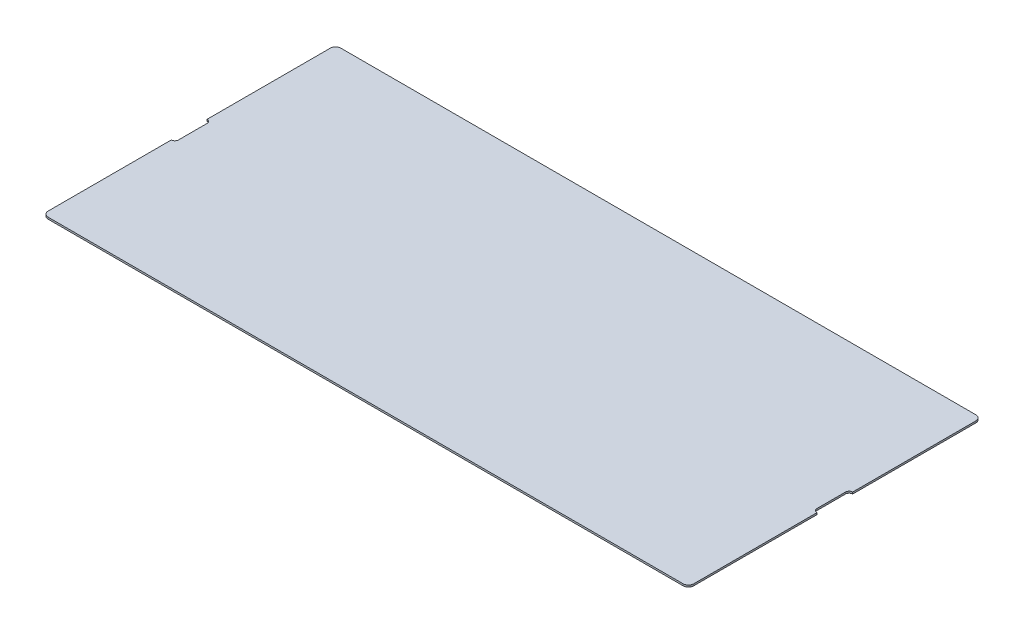
ISO-10303-21;
HEADER;
FILE_DESCRIPTION(('STEP AP214'),'2;1');
FILE_NAME('part.step','',(''),(''),'','','');
FILE_SCHEMA(('AUTOMOTIVE_DESIGN { 1 0 10303 214 1 1 1 1 }'));
ENDSEC;
DATA;
#1=APPLICATION_CONTEXT('core data for automotive mechanical design processes');
#2=APPLICATION_PROTOCOL_DEFINITION('international standard','automotive_design',2000,#1);
#3=PRODUCT_CONTEXT('',#1,'mechanical');
#4=PRODUCT('Part','Part','',(#3));
#5=PRODUCT_RELATED_PRODUCT_CATEGORY('part','',(#4));
#6=PRODUCT_DEFINITION_FORMATION('','',#4);
#7=PRODUCT_DEFINITION_CONTEXT('part definition',#1,'design');
#8=PRODUCT_DEFINITION('design','',#6,#7);
#9=PRODUCT_DEFINITION_SHAPE('','',#8);
#10=(LENGTH_UNIT() NAMED_UNIT(*) SI_UNIT(.MILLI.,.METRE.));
#11=(NAMED_UNIT(*) PLANE_ANGLE_UNIT() SI_UNIT($,.RADIAN.));
#12=(NAMED_UNIT(*) SI_UNIT($,.STERADIAN.) SOLID_ANGLE_UNIT());
#13=UNCERTAINTY_MEASURE_WITH_UNIT(LENGTH_MEASURE(1.E-05),#10,'distance_accuracy_value','');
#14=(GEOMETRIC_REPRESENTATION_CONTEXT(3) GLOBAL_UNCERTAINTY_ASSIGNED_CONTEXT((#13)) GLOBAL_UNIT_ASSIGNED_CONTEXT((#10,
#11,#12)) REPRESENTATION_CONTEXT('',''));
#15=CARTESIAN_POINT('',(0.,0.,0.));
#16=DIRECTION('',(0.,0.,1.));
#17=DIRECTION('',(1.,0.,0.));
#18=AXIS2_PLACEMENT_3D('',#15,#16,#17);
#19=CARTESIAN_POINT('',(90.2,0.5,0.));
#20=DIRECTION('',(1.,0.,0.));
#21=DIRECTION('',(0.,0.,-1.));
#22=AXIS2_PLACEMENT_3D('',#19,#20,#21);
#23=PLANE('',#22);
#24=DIRECTION('',(0.,0.,1.));
#25=VECTOR('',#24,1.);
#26=CARTESIAN_POINT('',(90.2,0.,0.));
#27=LINE('',#26,#25);
#28=CARTESIAN_POINT('',(90.2,0.,4.99999999999997));
#29=VERTEX_POINT('',#28);
#30=CARTESIAN_POINT('',(90.2,0.,39.4));
#31=VERTEX_POINT('',#30);
#32=EDGE_CURVE('E177',#29,#31,#27,.T.);
#33=ORIENTED_EDGE('',*,*,#32,.F.);
#34=DIRECTION('',(0.,-1.,0.));
#35=VECTOR('',#34,1.);
#36=CARTESIAN_POINT('',(90.2,0.5,4.99999999999997));
#37=LINE('',#36,#35);
#38=CARTESIAN_POINT('',(90.2,0.5,4.99999999999997));
#39=VERTEX_POINT('',#38);
#40=EDGE_CURVE('E11',#39,#29,#37,.T.);
#41=ORIENTED_EDGE('',*,*,#40,.F.);
#42=DIRECTION('',(0.,0.,1.));
#43=VECTOR('',#42,1.);
#44=CARTESIAN_POINT('',(90.2,0.5,0.));
#45=LINE('',#44,#43);
#46=CARTESIAN_POINT('',(90.2,0.5,39.4));
#47=VERTEX_POINT('',#46);
#48=EDGE_CURVE('E215',#39,#47,#45,.T.);
#49=ORIENTED_EDGE('',*,*,#48,.T.);
#50=DIRECTION('',(0.,-1.,0.));
#51=VECTOR('',#50,1.);
#52=CARTESIAN_POINT('',(90.2,0.5,39.4));
#53=LINE('',#52,#51);
#54=EDGE_CURVE('E110',#47,#31,#53,.T.);
#55=ORIENTED_EDGE('',*,*,#54,.T.);
#56=EDGE_LOOP('',(#33,#41,#49,#55));
#57=FACE_BOUND('',#56,.T.);
#58=ADVANCED_FACE('F34',(#57),#23,.T.);
#59=CARTESIAN_POINT('',(90.2,0.5,3.99999999999997));
#60=DIRECTION('',(0.,-1.,0.));
#61=DIRECTION('',(0.,0.,-1.));
#62=AXIS2_PLACEMENT_3D('',#59,#60,#61);
#63=CYLINDRICAL_SURFACE('',#62,1.);
#64=CARTESIAN_POINT('',(90.2,0.,3.99999999999997));
#65=DIRECTION('',(0.,1.,0.));
#66=DIRECTION('',(0.,0.,1.));
#67=AXIS2_PLACEMENT_3D('',#64,#65,#66);
#68=CIRCLE('',#67,1.);
#69=CARTESIAN_POINT('',(89.2,0.,3.99999999999997));
#70=VERTEX_POINT('',#69);
#71=EDGE_CURVE('E180',#29,#70,#68,.F.);
#72=ORIENTED_EDGE('',*,*,#71,.T.);
#73=DIRECTION('',(0.,-1.,0.));
#74=VECTOR('',#73,1.);
#75=CARTESIAN_POINT('',(89.2,0.5,3.99999999999997));
#76=LINE('',#75,#74);
#77=CARTESIAN_POINT('',(89.2,0.5,3.99999999999997));
#78=VERTEX_POINT('',#77);
#79=EDGE_CURVE('E43',#78,#70,#76,.T.);
#80=ORIENTED_EDGE('',*,*,#79,.F.);
#81=CARTESIAN_POINT('',(90.2,0.5,3.99999999999997));
#82=DIRECTION('',(0.,1.,0.));
#83=DIRECTION('',(0.,0.,1.));
#84=AXIS2_PLACEMENT_3D('',#81,#82,#83);
#85=CIRCLE('',#84,1.);
#86=EDGE_CURVE('E262',#39,#78,#85,.F.);
#87=ORIENTED_EDGE('',*,*,#86,.F.);
#88=ORIENTED_EDGE('',*,*,#40,.T.);
#89=EDGE_LOOP('',(#72,#80,#87,#88));
#90=FACE_BOUND('',#89,.T.);
#91=ADVANCED_FACE('F36',(#90),#63,.F.);
#92=CARTESIAN_POINT('',(89.2,0.5,-3.09474668114262E-13));
#93=DIRECTION('',(1.,0.,0.));
#94=DIRECTION('',(0.,0.,-1.));
#95=AXIS2_PLACEMENT_3D('',#92,#93,#94);
#96=PLANE('',#95);
#97=DIRECTION('',(0.,0.,1.));
#98=VECTOR('',#97,1.);
#99=CARTESIAN_POINT('',(89.2,0.,-3.09474668114262E-13));
#100=LINE('',#99,#98);
#101=CARTESIAN_POINT('',(89.2,0.,-4.00000000000003));
#102=VERTEX_POINT('',#101);
#103=EDGE_CURVE('E184',#102,#70,#100,.T.);
#104=ORIENTED_EDGE('',*,*,#103,.F.);
#105=DIRECTION('',(0.,-1.,0.));
#106=VECTOR('',#105,1.);
#107=CARTESIAN_POINT('',(89.2,0.5,-4.00000000000003));
#108=LINE('',#107,#106);
#109=CARTESIAN_POINT('',(89.2,0.5,-4.00000000000003));
#110=VERTEX_POINT('',#109);
#111=EDGE_CURVE('E238',#110,#102,#108,.T.);
#112=ORIENTED_EDGE('',*,*,#111,.F.);
#113=DIRECTION('',(0.,0.,1.));
#114=VECTOR('',#113,1.);
#115=CARTESIAN_POINT('',(89.2,0.5,-3.09474668114262E-13));
#116=LINE('',#115,#114);
#117=EDGE_CURVE('E245',#110,#78,#116,.T.);
#118=ORIENTED_EDGE('',*,*,#117,.T.);
#119=ORIENTED_EDGE('',*,*,#79,.T.);
#120=EDGE_LOOP('',(#104,#112,#118,#119));
#121=FACE_BOUND('',#120,.T.);
#122=ADVANCED_FACE('F243',(#121),#96,.T.);
#123=CARTESIAN_POINT('',(90.2,0.5,-4.00000000000003));
#124=DIRECTION('',(0.,-1.,0.));
#125=DIRECTION('',(0.,0.,-1.));
#126=AXIS2_PLACEMENT_3D('',#123,#124,#125);
#127=CYLINDRICAL_SURFACE('',#126,1.);
#128=CARTESIAN_POINT('',(90.2,0.,-4.00000000000003));
#129=DIRECTION('',(0.,1.,0.));
#130=DIRECTION('',(0.,0.,1.));
#131=AXIS2_PLACEMENT_3D('',#128,#129,#130);
#132=CIRCLE('',#131,1.);
#133=CARTESIAN_POINT('',(90.2,0.,-5.00000000000003));
#134=VERTEX_POINT('',#133);
#135=EDGE_CURVE('E187',#102,#134,#132,.F.);
#136=ORIENTED_EDGE('',*,*,#135,.T.);
#137=DIRECTION('',(0.,-1.,0.));
#138=VECTOR('',#137,1.);
#139=CARTESIAN_POINT('',(90.2,0.5,-5.00000000000003));
#140=LINE('',#139,#138);
#141=CARTESIAN_POINT('',(90.2,0.5,-5.00000000000003));
#142=VERTEX_POINT('',#141);
#143=EDGE_CURVE('E236',#142,#134,#140,.T.);
#144=ORIENTED_EDGE('',*,*,#143,.F.);
#145=CARTESIAN_POINT('',(90.2,0.5,-4.00000000000003));
#146=DIRECTION('',(0.,1.,0.));
#147=DIRECTION('',(0.,0.,1.));
#148=AXIS2_PLACEMENT_3D('',#145,#146,#147);
#149=CIRCLE('',#148,1.);
#150=EDGE_CURVE('E258',#110,#142,#149,.F.);
#151=ORIENTED_EDGE('',*,*,#150,.F.);
#152=ORIENTED_EDGE('',*,*,#111,.T.);
#153=EDGE_LOOP('',(#136,#144,#151,#152));
#154=FACE_BOUND('',#153,.T.);
#155=ADVANCED_FACE('F255',(#154),#127,.F.);
#156=CARTESIAN_POINT('',(90.2,0.,-39.4));
#157=VERTEX_POINT('',#156);
#158=EDGE_CURVE('E181',#157,#134,#27,.T.);
#159=ORIENTED_EDGE('',*,*,#158,.F.);
#160=DIRECTION('',(0.,-1.,0.));
#161=VECTOR('',#160,1.);
#162=CARTESIAN_POINT('',(90.2,0.5,-39.4));
#163=LINE('',#162,#161);
#164=CARTESIAN_POINT('',(90.2,0.5,-39.4));
#165=VERTEX_POINT('',#164);
#166=EDGE_CURVE('E234',#165,#157,#163,.T.);
#167=ORIENTED_EDGE('',*,*,#166,.F.);
#168=EDGE_CURVE('E260',#165,#142,#45,.T.);
#169=ORIENTED_EDGE('',*,*,#168,.T.);
#170=ORIENTED_EDGE('',*,*,#143,.T.);
#171=EDGE_LOOP('',(#159,#167,#169,#170));
#172=FACE_BOUND('',#171,.T.);
#173=ADVANCED_FACE('F311',(#172),#23,.T.);
#174=CARTESIAN_POINT('',(88.7,0.5,-39.4));
#175=DIRECTION('',(0.,-1.,0.));
#176=DIRECTION('',(0.,0.,-1.));
#177=AXIS2_PLACEMENT_3D('',#174,#175,#176);
#178=CYLINDRICAL_SURFACE('',#177,1.5);
#179=CARTESIAN_POINT('',(88.7,0.,-39.4));
#180=DIRECTION('',(0.,1.,0.));
#181=DIRECTION('',(0.,0.,1.));
#182=AXIS2_PLACEMENT_3D('',#179,#180,#181);
#183=CIRCLE('',#182,1.5);
#184=CARTESIAN_POINT('',(88.7,0.,-40.9));
#185=VERTEX_POINT('',#184);
#186=EDGE_CURVE('E190',#185,#157,#183,.F.);
#187=ORIENTED_EDGE('',*,*,#186,.F.);
#188=DIRECTION('',(0.,-1.,0.));
#189=VECTOR('',#188,1.);
#190=CARTESIAN_POINT('',(88.7,0.5,-40.9));
#191=LINE('',#190,#189);
#192=CARTESIAN_POINT('',(88.7,0.5,-40.9));
#193=VERTEX_POINT('',#192);
#194=EDGE_CURVE('E232',#193,#185,#191,.T.);
#195=ORIENTED_EDGE('',*,*,#194,.F.);
#196=CARTESIAN_POINT('',(88.7,0.5,-39.4));
#197=DIRECTION('',(0.,1.,0.));
#198=DIRECTION('',(0.,0.,1.));
#199=AXIS2_PLACEMENT_3D('',#196,#197,#198);
#200=CIRCLE('',#199,1.5);
#201=EDGE_CURVE('E267',#193,#165,#200,.F.);
#202=ORIENTED_EDGE('',*,*,#201,.T.);
#203=ORIENTED_EDGE('',*,*,#166,.T.);
#204=EDGE_LOOP('',(#187,#195,#202,#203));
#205=FACE_BOUND('',#204,.T.);
#206=ADVANCED_FACE('F318',(#205),#178,.T.);
#207=CARTESIAN_POINT('',(0.,0.5,-40.9));
#208=DIRECTION('',(0.,0.,-1.));
#209=DIRECTION('',(-1.,0.,0.));
#210=AXIS2_PLACEMENT_3D('',#207,#208,#209);
#211=PLANE('',#210);
#212=DIRECTION('',(1.,0.,0.));
#213=VECTOR('',#212,1.);
#214=CARTESIAN_POINT('',(0.,0.,-40.9));
#215=LINE('',#214,#213);
#216=CARTESIAN_POINT('',(-88.7,0.,-40.9));
#217=VERTEX_POINT('',#216);
#218=EDGE_CURVE('E193',#217,#185,#215,.T.);
#219=ORIENTED_EDGE('',*,*,#218,.F.);
#220=DIRECTION('',(0.,-1.,0.));
#221=VECTOR('',#220,1.);
#222=CARTESIAN_POINT('',(-88.7,0.5,-40.9));
#223=LINE('',#222,#221);
#224=CARTESIAN_POINT('',(-88.7,0.5,-40.9));
#225=VERTEX_POINT('',#224);
#226=EDGE_CURVE('E230',#225,#217,#223,.T.);
#227=ORIENTED_EDGE('',*,*,#226,.F.);
#228=DIRECTION('',(1.,0.,0.));
#229=VECTOR('',#228,1.);
#230=CARTESIAN_POINT('',(0.,0.5,-40.9));
#231=LINE('',#230,#229);
#232=EDGE_CURVE('E270',#225,#193,#231,.T.);
#233=ORIENTED_EDGE('',*,*,#232,.T.);
#234=ORIENTED_EDGE('',*,*,#194,.T.);
#235=EDGE_LOOP('',(#219,#227,#233,#234));
#236=FACE_BOUND('',#235,.T.);
#237=ADVANCED_FACE('F324',(#236),#211,.T.);
#238=CARTESIAN_POINT('',(-88.7,0.5,-39.4));
#239=DIRECTION('',(0.,-1.,0.));
#240=DIRECTION('',(0.,0.,-1.));
#241=AXIS2_PLACEMENT_3D('',#238,#239,#240);
#242=CYLINDRICAL_SURFACE('',#241,1.5);
#243=CARTESIAN_POINT('',(-88.7,0.,-39.4));
#244=DIRECTION('',(0.,1.,0.));
#245=DIRECTION('',(0.,0.,1.));
#246=AXIS2_PLACEMENT_3D('',#243,#244,#245);
#247=CIRCLE('',#246,1.5);
#248=CARTESIAN_POINT('',(-90.2,0.,-39.4));
#249=VERTEX_POINT('',#248);
#250=EDGE_CURVE('E196',#217,#249,#247,.T.);
#251=ORIENTED_EDGE('',*,*,#250,.T.);
#252=DIRECTION('',(0.,-1.,0.));
#253=VECTOR('',#252,1.);
#254=CARTESIAN_POINT('',(-90.2,0.5,-39.4));
#255=LINE('',#254,#253);
#256=CARTESIAN_POINT('',(-90.2,0.5,-39.4));
#257=VERTEX_POINT('',#256);
#258=EDGE_CURVE('E227',#257,#249,#255,.T.);
#259=ORIENTED_EDGE('',*,*,#258,.F.);
#260=CARTESIAN_POINT('',(-88.7,0.5,-39.4));
#261=DIRECTION('',(0.,1.,0.));
#262=DIRECTION('',(0.,0.,1.));
#263=AXIS2_PLACEMENT_3D('',#260,#261,#262);
#264=CIRCLE('',#263,1.5);
#265=EDGE_CURVE('E273',#225,#257,#264,.T.);
#266=ORIENTED_EDGE('',*,*,#265,.F.);
#267=ORIENTED_EDGE('',*,*,#226,.T.);
#268=EDGE_LOOP('',(#251,#259,#266,#267));
#269=FACE_BOUND('',#268,.T.);
#270=ADVANCED_FACE('F307',(#269),#242,.T.);
#271=CARTESIAN_POINT('',(-90.2,0.5,0.));
#272=DIRECTION('',(1.,0.,0.));
#273=DIRECTION('',(0.,0.,-1.));
#274=AXIS2_PLACEMENT_3D('',#271,#272,#273);
#275=PLANE('',#274);
#276=DIRECTION('',(0.,0.,1.));
#277=VECTOR('',#276,1.);
#278=CARTESIAN_POINT('',(-90.2,0.,0.));
#279=LINE('',#278,#277);
#280=CARTESIAN_POINT('',(-90.2,0.,-5.));
#281=VERTEX_POINT('',#280);
#282=EDGE_CURVE('E198',#249,#281,#279,.T.);
#283=ORIENTED_EDGE('',*,*,#282,.T.);
#284=DIRECTION('',(0.,-1.,0.));
#285=VECTOR('',#284,1.);
#286=CARTESIAN_POINT('',(-90.2,0.5,-5.));
#287=LINE('',#286,#285);
#288=CARTESIAN_POINT('',(-90.2,0.5,-5.));
#289=VERTEX_POINT('',#288);
#290=EDGE_CURVE('E225',#289,#281,#287,.T.);
#291=ORIENTED_EDGE('',*,*,#290,.F.);
#292=DIRECTION('',(0.,0.,1.));
#293=VECTOR('',#292,1.);
#294=CARTESIAN_POINT('',(-90.2,0.5,0.));
#295=LINE('',#294,#293);
#296=EDGE_CURVE('E275',#257,#289,#295,.T.);
#297=ORIENTED_EDGE('',*,*,#296,.F.);
#298=ORIENTED_EDGE('',*,*,#258,.T.);
#299=EDGE_LOOP('',(#283,#291,#297,#298));
#300=FACE_BOUND('',#299,.T.);
#301=ADVANCED_FACE('F298',(#300),#275,.F.);
#302=CARTESIAN_POINT('',(-90.2,0.5,-4.));
#303=DIRECTION('',(0.,-1.,0.));
#304=DIRECTION('',(0.,0.,-1.));
#305=AXIS2_PLACEMENT_3D('',#302,#303,#304);
#306=CYLINDRICAL_SURFACE('',#305,1.);
#307=CARTESIAN_POINT('',(-90.2,0.,-4.));
#308=DIRECTION('',(0.,1.,0.));
#309=DIRECTION('',(0.,0.,1.));
#310=AXIS2_PLACEMENT_3D('',#307,#308,#309);
#311=CIRCLE('',#310,1.);
#312=CARTESIAN_POINT('',(-89.2,0.,-4.));
#313=VERTEX_POINT('',#312);
#314=EDGE_CURVE('E201',#313,#281,#311,.T.);
#315=ORIENTED_EDGE('',*,*,#314,.F.);
#316=DIRECTION('',(0.,-1.,0.));
#317=VECTOR('',#316,1.);
#318=CARTESIAN_POINT('',(-89.2,0.5,-4.));
#319=LINE('',#318,#317);
#320=CARTESIAN_POINT('',(-89.2,0.5,-4.));
#321=VERTEX_POINT('',#320);
#322=EDGE_CURVE('E223',#321,#313,#319,.T.);
#323=ORIENTED_EDGE('',*,*,#322,.F.);
#324=CARTESIAN_POINT('',(-90.2,0.5,-4.));
#325=DIRECTION('',(0.,1.,0.));
#326=DIRECTION('',(0.,0.,1.));
#327=AXIS2_PLACEMENT_3D('',#324,#325,#326);
#328=CIRCLE('',#327,1.);
#329=EDGE_CURVE('E277',#321,#289,#328,.T.);
#330=ORIENTED_EDGE('',*,*,#329,.T.);
#331=ORIENTED_EDGE('',*,*,#290,.T.);
#332=EDGE_LOOP('',(#315,#323,#330,#331));
#333=FACE_BOUND('',#332,.T.);
#334=ADVANCED_FACE('F306',(#333),#306,.F.);
#335=CARTESIAN_POINT('',(-89.2,0.5,0.));
#336=DIRECTION('',(1.,0.,0.));
#337=DIRECTION('',(0.,0.,-1.));
#338=AXIS2_PLACEMENT_3D('',#335,#336,#337);
#339=PLANE('',#338);
#340=DIRECTION('',(0.,0.,1.));
#341=VECTOR('',#340,1.);
#342=CARTESIAN_POINT('',(-89.2,0.,0.));
#343=LINE('',#342,#341);
#344=CARTESIAN_POINT('',(-89.2,0.,4.));
#345=VERTEX_POINT('',#344);
#346=EDGE_CURVE('E205',#313,#345,#343,.T.);
#347=ORIENTED_EDGE('',*,*,#346,.T.);
#348=DIRECTION('',(0.,-1.,0.));
#349=VECTOR('',#348,1.);
#350=CARTESIAN_POINT('',(-89.2,0.5,4.));
#351=LINE('',#350,#349);
#352=CARTESIAN_POINT('',(-89.2,0.5,4.));
#353=VERTEX_POINT('',#352);
#354=EDGE_CURVE('E221',#353,#345,#351,.T.);
#355=ORIENTED_EDGE('',*,*,#354,.F.);
#356=DIRECTION('',(0.,0.,1.));
#357=VECTOR('',#356,1.);
#358=CARTESIAN_POINT('',(-89.2,0.5,0.));
#359=LINE('',#358,#357);
#360=EDGE_CURVE('E280',#321,#353,#359,.T.);
#361=ORIENTED_EDGE('',*,*,#360,.F.);
#362=ORIENTED_EDGE('',*,*,#322,.T.);
#363=EDGE_LOOP('',(#347,#355,#361,#362));
#364=FACE_BOUND('',#363,.T.);
#365=ADVANCED_FACE('F290',(#364),#339,.F.);
#366=CARTESIAN_POINT('',(-90.2,0.5,4.));
#367=DIRECTION('',(0.,-1.,0.));
#368=DIRECTION('',(0.,0.,-1.));
#369=AXIS2_PLACEMENT_3D('',#366,#367,#368);
#370=CYLINDRICAL_SURFACE('',#369,1.);
#371=CARTESIAN_POINT('',(-90.2,0.,4.));
#372=DIRECTION('',(0.,1.,0.));
#373=DIRECTION('',(0.,0.,1.));
#374=AXIS2_PLACEMENT_3D('',#371,#372,#373);
#375=CIRCLE('',#374,1.);
#376=CARTESIAN_POINT('',(-90.2,0.,5.));
#377=VERTEX_POINT('',#376);
#378=EDGE_CURVE('E208',#377,#345,#375,.T.);
#379=ORIENTED_EDGE('',*,*,#378,.F.);
#380=DIRECTION('',(0.,-1.,0.));
#381=VECTOR('',#380,1.);
#382=CARTESIAN_POINT('',(-90.2,0.5,5.));
#383=LINE('',#382,#381);
#384=CARTESIAN_POINT('',(-90.2,0.5,5.));
#385=VERTEX_POINT('',#384);
#386=EDGE_CURVE('E219',#385,#377,#383,.T.);
#387=ORIENTED_EDGE('',*,*,#386,.F.);
#388=CARTESIAN_POINT('',(-90.2,0.5,4.));
#389=DIRECTION('',(0.,1.,0.));
#390=DIRECTION('',(0.,0.,1.));
#391=AXIS2_PLACEMENT_3D('',#388,#389,#390);
#392=CIRCLE('',#391,1.);
#393=EDGE_CURVE('E281',#385,#353,#392,.T.);
#394=ORIENTED_EDGE('',*,*,#393,.T.);
#395=ORIENTED_EDGE('',*,*,#354,.T.);
#396=EDGE_LOOP('',(#379,#387,#394,#395));
#397=FACE_BOUND('',#396,.T.);
#398=ADVANCED_FACE('F285',(#397),#370,.F.);
#399=CARTESIAN_POINT('',(-90.2,0.,39.4));
#400=VERTEX_POINT('',#399);
#401=EDGE_CURVE('E202',#377,#400,#279,.T.);
#402=ORIENTED_EDGE('',*,*,#401,.T.);
#403=DIRECTION('',(0.,-1.,0.));
#404=VECTOR('',#403,1.);
#405=CARTESIAN_POINT('',(-90.2,0.5,39.4));
#406=LINE('',#405,#404);
#407=CARTESIAN_POINT('',(-90.2,0.5,39.4));
#408=VERTEX_POINT('',#407);
#409=EDGE_CURVE('E169',#408,#400,#406,.T.);
#410=ORIENTED_EDGE('',*,*,#409,.F.);
#411=EDGE_CURVE('E160',#385,#408,#295,.T.);
#412=ORIENTED_EDGE('',*,*,#411,.F.);
#413=ORIENTED_EDGE('',*,*,#386,.T.);
#414=EDGE_LOOP('',(#402,#410,#412,#413));
#415=FACE_BOUND('',#414,.T.);
#416=ADVANCED_FACE('F295',(#415),#275,.F.);
#417=CARTESIAN_POINT('',(-88.7,0.5,39.4));
#418=DIRECTION('',(0.,-1.,0.));
#419=DIRECTION('',(0.,0.,-1.));
#420=AXIS2_PLACEMENT_3D('',#417,#418,#419);
#421=CYLINDRICAL_SURFACE('',#420,1.5);
#422=CARTESIAN_POINT('',(-88.7,0.,39.4));
#423=DIRECTION('',(0.,1.,0.));
#424=DIRECTION('',(0.,0.,1.));
#425=AXIS2_PLACEMENT_3D('',#422,#423,#424);
#426=CIRCLE('',#425,1.5);
#427=CARTESIAN_POINT('',(-88.7,0.,40.9));
#428=VERTEX_POINT('',#427);
#429=EDGE_CURVE('E168',#400,#428,#426,.T.);
#430=ORIENTED_EDGE('',*,*,#429,.T.);
#431=DIRECTION('',(0.,-1.,0.));
#432=VECTOR('',#431,1.);
#433=CARTESIAN_POINT('',(-88.7,0.5,40.9));
#434=LINE('',#433,#432);
#435=CARTESIAN_POINT('',(-88.7,0.5,40.9));
#436=VERTEX_POINT('',#435);
#437=EDGE_CURVE('E165',#436,#428,#434,.T.);
#438=ORIENTED_EDGE('',*,*,#437,.F.);
#439=CARTESIAN_POINT('',(-88.7,0.5,39.4));
#440=DIRECTION('',(0.,1.,0.));
#441=DIRECTION('',(0.,0.,1.));
#442=AXIS2_PLACEMENT_3D('',#439,#440,#441);
#443=CIRCLE('',#442,1.5);
#444=EDGE_CURVE('E153',#408,#436,#443,.T.);
#445=ORIENTED_EDGE('',*,*,#444,.F.);
#446=ORIENTED_EDGE('',*,*,#409,.T.);
#447=EDGE_LOOP('',(#430,#438,#445,#446));
#448=FACE_BOUND('',#447,.T.);
#449=ADVANCED_FACE('F166',(#448),#421,.T.);
#450=CARTESIAN_POINT('',(0.,0.5,40.9));
#451=DIRECTION('',(0.,0.,-1.));
#452=DIRECTION('',(-1.,0.,0.));
#453=AXIS2_PLACEMENT_3D('',#450,#451,#452);
#454=PLANE('',#453);
#455=DIRECTION('',(1.,0.,0.));
#456=VECTOR('',#455,1.);
#457=CARTESIAN_POINT('',(0.,0.,40.9));
#458=LINE('',#457,#456);
#459=CARTESIAN_POINT('',(88.7,0.,40.9));
#460=VERTEX_POINT('',#459);
#461=EDGE_CURVE('E103',#428,#460,#458,.T.);
#462=ORIENTED_EDGE('',*,*,#461,.T.);
#463=DIRECTION('',(0.,-1.,0.));
#464=VECTOR('',#463,1.);
#465=CARTESIAN_POINT('',(88.7,0.5,40.9));
#466=LINE('',#465,#464);
#467=CARTESIAN_POINT('',(88.7,0.5,40.9));
#468=VERTEX_POINT('',#467);
#469=EDGE_CURVE('E170',#468,#460,#466,.T.);
#470=ORIENTED_EDGE('',*,*,#469,.F.);
#471=DIRECTION('',(1.,0.,0.));
#472=VECTOR('',#471,1.);
#473=CARTESIAN_POINT('',(0.,0.5,40.9));
#474=LINE('',#473,#472);
#475=EDGE_CURVE('E157',#436,#468,#474,.T.);
#476=ORIENTED_EDGE('',*,*,#475,.F.);
#477=ORIENTED_EDGE('',*,*,#437,.T.);
#478=EDGE_LOOP('',(#462,#470,#476,#477));
#479=FACE_BOUND('',#478,.T.);
#480=ADVANCED_FACE('F172',(#479),#454,.F.);
#481=CARTESIAN_POINT('',(88.7,0.5,39.4));
#482=DIRECTION('',(0.,-1.,0.));
#483=DIRECTION('',(0.,0.,-1.));
#484=AXIS2_PLACEMENT_3D('',#481,#482,#483);
#485=CYLINDRICAL_SURFACE('',#484,1.5);
#486=CARTESIAN_POINT('',(88.7,0.,39.4));
#487=DIRECTION('',(0.,1.,0.));
#488=DIRECTION('',(0.,0.,1.));
#489=AXIS2_PLACEMENT_3D('',#486,#487,#488);
#490=CIRCLE('',#489,1.5);
#491=EDGE_CURVE('E213',#460,#31,#490,.T.);
#492=ORIENTED_EDGE('',*,*,#491,.T.);
#493=ORIENTED_EDGE('',*,*,#54,.F.);
#494=CARTESIAN_POINT('',(88.7,0.5,39.4));
#495=DIRECTION('',(0.,1.,0.));
#496=DIRECTION('',(0.,0.,1.));
#497=AXIS2_PLACEMENT_3D('',#494,#495,#496);
#498=CIRCLE('',#497,1.5);
#499=EDGE_CURVE('E51',#468,#47,#498,.T.);
#500=ORIENTED_EDGE('',*,*,#499,.F.);
#501=ORIENTED_EDGE('',*,*,#469,.T.);
#502=EDGE_LOOP('',(#492,#493,#500,#501));
#503=FACE_BOUND('',#502,.T.);
#504=ADVANCED_FACE('F396',(#503),#485,.T.);
#505=CARTESIAN_POINT('',(0.,0.5,0.));
#506=DIRECTION('',(0.,1.,0.));
#507=DIRECTION('',(0.,0.,1.));
#508=AXIS2_PLACEMENT_3D('',#505,#506,#507);
#509=PLANE('',#508);
#510=ORIENTED_EDGE('',*,*,#48,.F.);
#511=ORIENTED_EDGE('',*,*,#86,.T.);
#512=ORIENTED_EDGE('',*,*,#117,.F.);
#513=ORIENTED_EDGE('',*,*,#150,.T.);
#514=ORIENTED_EDGE('',*,*,#168,.F.);
#515=ORIENTED_EDGE('',*,*,#201,.F.);
#516=ORIENTED_EDGE('',*,*,#232,.F.);
#517=ORIENTED_EDGE('',*,*,#265,.T.);
#518=ORIENTED_EDGE('',*,*,#296,.T.);
#519=ORIENTED_EDGE('',*,*,#329,.F.);
#520=ORIENTED_EDGE('',*,*,#360,.T.);
#521=ORIENTED_EDGE('',*,*,#393,.F.);
#522=ORIENTED_EDGE('',*,*,#411,.T.);
#523=ORIENTED_EDGE('',*,*,#444,.T.);
#524=ORIENTED_EDGE('',*,*,#475,.T.);
#525=ORIENTED_EDGE('',*,*,#499,.T.);
#526=EDGE_LOOP('',(#510,#511,#512,#513,#514,#515,#516,#517,#518,#519,#520,#521,#522,#523,#524,#525));
#527=FACE_BOUND('',#526,.T.);
#528=ADVANCED_FACE('F155',(#527),#509,.T.);
#529=CARTESIAN_POINT('',(0.,0.,0.));
#530=DIRECTION('',(0.,1.,0.));
#531=DIRECTION('',(0.,0.,1.));
#532=AXIS2_PLACEMENT_3D('',#529,#530,#531);
#533=PLANE('',#532);
#534=ORIENTED_EDGE('',*,*,#32,.T.);
#535=ORIENTED_EDGE('',*,*,#491,.F.);
#536=ORIENTED_EDGE('',*,*,#461,.F.);
#537=ORIENTED_EDGE('',*,*,#429,.F.);
#538=ORIENTED_EDGE('',*,*,#401,.F.);
#539=ORIENTED_EDGE('',*,*,#378,.T.);
#540=ORIENTED_EDGE('',*,*,#346,.F.);
#541=ORIENTED_EDGE('',*,*,#314,.T.);
#542=ORIENTED_EDGE('',*,*,#282,.F.);
#543=ORIENTED_EDGE('',*,*,#250,.F.);
#544=ORIENTED_EDGE('',*,*,#218,.T.);
#545=ORIENTED_EDGE('',*,*,#186,.T.);
#546=ORIENTED_EDGE('',*,*,#158,.T.);
#547=ORIENTED_EDGE('',*,*,#135,.F.);
#548=ORIENTED_EDGE('',*,*,#103,.T.);
#549=ORIENTED_EDGE('',*,*,#71,.F.);
#550=EDGE_LOOP('',(#534,#535,#536,#537,#538,#539,#540,#541,#542,#543,#544,#545,#546,#547,#548,#549));
#551=FACE_BOUND('',#550,.T.);
#552=ADVANCED_FACE('F250',(#551),#533,.F.);
#553=CLOSED_SHELL('',(#58,#91,#122,#155,#173,#206,#237,#270,#301,#334,#365,#398,#416,#449,#480,
#504,#528,#552));
#554=MANIFOLD_SOLID_BREP('B2',#553);
#555=ADVANCED_BREP_SHAPE_REPRESENTATION('',(#18,#554),#14);
#556=SHAPE_DEFINITION_REPRESENTATION(#9,#555);
ENDSEC;
END-ISO-10303-21;
